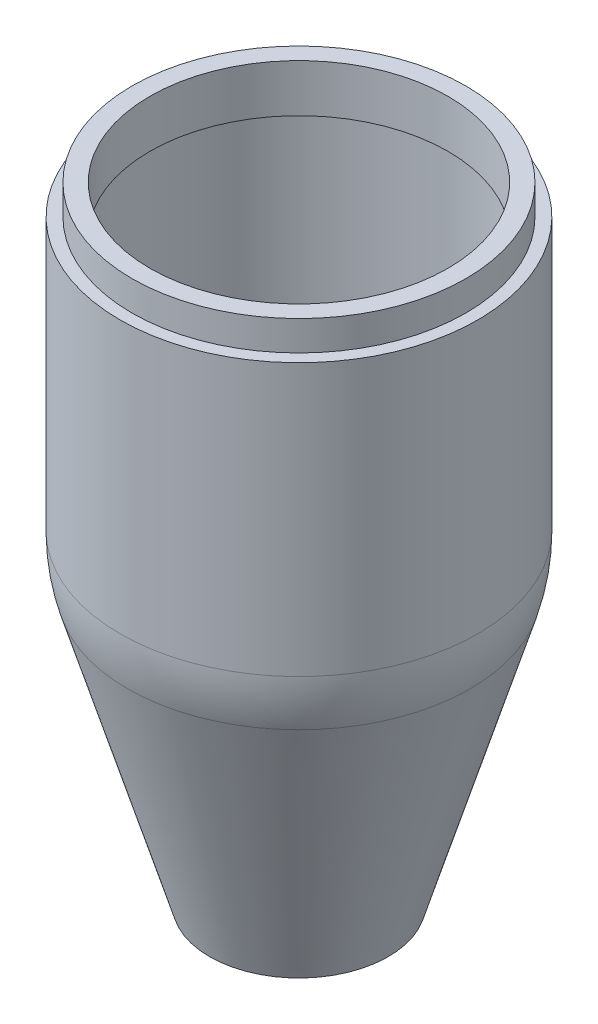
ISO-10303-21;
HEADER;
FILE_DESCRIPTION(('STEP AP214'),'2;1');
FILE_NAME('part.step','',(''),(''),'','','');
FILE_SCHEMA(('AUTOMOTIVE_DESIGN { 1 0 10303 214 1 1 1 1 }'));
ENDSEC;
DATA;
#1=APPLICATION_CONTEXT('core data for automotive mechanical design processes');
#2=APPLICATION_PROTOCOL_DEFINITION('international standard','automotive_design',2000,#1);
#3=PRODUCT_CONTEXT('',#1,'mechanical');
#4=PRODUCT('Part','Part','',(#3));
#5=PRODUCT_RELATED_PRODUCT_CATEGORY('part','',(#4));
#6=PRODUCT_DEFINITION_FORMATION('','',#4);
#7=PRODUCT_DEFINITION_CONTEXT('part definition',#1,'design');
#8=PRODUCT_DEFINITION('design','',#6,#7);
#9=PRODUCT_DEFINITION_SHAPE('','',#8);
#10=(LENGTH_UNIT() NAMED_UNIT(*) SI_UNIT(.MILLI.,.METRE.));
#11=(NAMED_UNIT(*) PLANE_ANGLE_UNIT() SI_UNIT($,.RADIAN.));
#12=(NAMED_UNIT(*) SI_UNIT($,.STERADIAN.) SOLID_ANGLE_UNIT());
#13=UNCERTAINTY_MEASURE_WITH_UNIT(LENGTH_MEASURE(1.E-05),#10,'distance_accuracy_value','');
#14=(GEOMETRIC_REPRESENTATION_CONTEXT(3) GLOBAL_UNCERTAINTY_ASSIGNED_CONTEXT((#13)) GLOBAL_UNIT_ASSIGNED_CONTEXT((#10,
#11,#12)) REPRESENTATION_CONTEXT('',''));
#15=CARTESIAN_POINT('',(0.,0.,0.));
#16=DIRECTION('',(0.,0.,1.));
#17=DIRECTION('',(1.,0.,0.));
#18=AXIS2_PLACEMENT_3D('',#15,#16,#17);
#19=CARTESIAN_POINT('',(0.,100.,0.));
#20=DIRECTION('',(0.,-1.,0.));
#21=DIRECTION('',(0.,0.,-1.));
#22=AXIS2_PLACEMENT_3D('',#19,#20,#21);
#23=PLANE('',#22);
#24=CARTESIAN_POINT('',(0.,100.,0.));
#25=DIRECTION('',(0.,1.,0.));
#26=DIRECTION('',(0.,0.,1.));
#27=AXIS2_PLACEMENT_3D('',#24,#25,#26);
#28=CIRCLE('',#27,30.);
#29=CARTESIAN_POINT('',(0.,100.,30.));
#30=VERTEX_POINT('',#29);
#31=EDGE_CURVE('E48',#30,#30,#28,.T.);
#32=ORIENTED_EDGE('',*,*,#31,.T.);
#33=EDGE_LOOP('',(#32));
#34=FACE_BOUND('',#33,.T.);
#35=CARTESIAN_POINT('',(0.,100.,0.));
#36=DIRECTION('',(0.,-1.,0.));
#37=DIRECTION('',(0.,0.,-1.));
#38=AXIS2_PLACEMENT_3D('',#35,#36,#37);
#39=CIRCLE('',#38,28.);
#40=CARTESIAN_POINT('',(0.,100.,-28.));
#41=VERTEX_POINT('',#40);
#42=EDGE_CURVE('E10',#41,#41,#39,.F.);
#43=ORIENTED_EDGE('',*,*,#42,.F.);
#44=EDGE_LOOP('',(#43));
#45=FACE_BOUND('',#44,.T.);
#46=ADVANCED_FACE('F41',(#34,#45),#23,.F.);
#47=CARTESIAN_POINT('',(15.,0.,0.));
#48=DIRECTION('',(0.,1.,0.));
#49=DIRECTION('',(0.,0.,1.));
#50=AXIS2_PLACEMENT_3D('',#47,#48,#49);
#51=PLANE('',#50);
#52=CARTESIAN_POINT('',(0.,0.,0.));
#53=DIRECTION('',(0.,1.,0.));
#54=DIRECTION('',(0.,0.,1.));
#55=AXIS2_PLACEMENT_3D('',#52,#53,#54);
#56=CIRCLE('',#55,11.8679080473268);
#57=CARTESIAN_POINT('',(0.,0.,11.8679080473268));
#58=VERTEX_POINT('',#57);
#59=EDGE_CURVE('E71',#58,#58,#56,.T.);
#60=ORIENTED_EDGE('',*,*,#59,.T.);
#61=EDGE_LOOP('',(#60));
#62=FACE_BOUND('',#61,.T.);
#63=CARTESIAN_POINT('',(0.,0.,0.));
#64=DIRECTION('',(0.,1.,0.));
#65=DIRECTION('',(0.,0.,1.));
#66=AXIS2_PLACEMENT_3D('',#63,#64,#65);
#67=CIRCLE('',#66,15.);
#68=CARTESIAN_POINT('',(0.,0.,15.));
#69=VERTEX_POINT('',#68);
#70=EDGE_CURVE('E61',#69,#69,#67,.T.);
#71=ORIENTED_EDGE('',*,*,#70,.F.);
#72=EDGE_LOOP('',(#71));
#73=FACE_BOUND('',#72,.T.);
#74=ADVANCED_FACE('F43',(#62,#73),#51,.F.);
#75=CARTESIAN_POINT('',(0.,126.662122272541,0.));
#76=DIRECTION('',(0.,1.,0.));
#77=DIRECTION('',(0.,0.,1.));
#78=AXIS2_PLACEMENT_3D('',#75,#76,#77);
#79=CYLINDRICAL_SURFACE('',#78,30.);
#80=ORIENTED_EDGE('',*,*,#31,.F.);
#81=EDGE_LOOP('',(#80));
#82=FACE_BOUND('',#81,.T.);
#83=CARTESIAN_POINT('',(0.,54.4030650891055,0.));
#84=DIRECTION('',(0.,1.,0.));
#85=DIRECTION('',(0.,0.,1.));
#86=AXIS2_PLACEMENT_3D('',#83,#84,#85);
#87=CIRCLE('',#86,30.);
#88=CARTESIAN_POINT('',(0.,54.4030650891055,30.));
#89=VERTEX_POINT('',#88);
#90=EDGE_CURVE('E52',#89,#89,#87,.T.);
#91=ORIENTED_EDGE('',*,*,#90,.T.);
#92=EDGE_LOOP('',(#91));
#93=FACE_BOUND('',#92,.T.);
#94=ADVANCED_FACE('F114',(#82,#93),#79,.T.);
#95=CARTESIAN_POINT('',(0.,54.4030650891055,0.));
#96=DIRECTION('',(0.,1.,0.));
#97=DIRECTION('',(1.,0.,0.));
#98=AXIS2_PLACEMENT_3D('',#95,#96,#97);
#99=SPHERICAL_SURFACE('',#98,30.);
#100=ORIENTED_EDGE('',*,*,#90,.F.);
#101=EDGE_LOOP('',(#100));
#102=FACE_BOUND('',#101,.T.);
#103=CARTESIAN_POINT('',(0.,45.7826285221151,0.));
#104=DIRECTION('',(0.,1.,0.));
#105=DIRECTION('',(0.,0.,1.));
#106=AXIS2_PLACEMENT_3D('',#103,#104,#105);
#107=CIRCLE('',#106,28.7347885566345);
#108=CARTESIAN_POINT('',(0.,45.7826285221151,28.7347885566345));
#109=VERTEX_POINT('',#108);
#110=EDGE_CURVE('E56',#109,#109,#107,.T.);
#111=ORIENTED_EDGE('',*,*,#110,.T.);
#112=EDGE_LOOP('',(#111));
#113=FACE_BOUND('',#112,.T.);
#114=ADVANCED_FACE('F120',(#102,#113),#99,.T.);
#115=CARTESIAN_POINT('',(0.,0.,0.));
#116=DIRECTION('',(0.,1.,0.));
#117=DIRECTION('',(0.,0.,1.));
#118=AXIS2_PLACEMENT_3D('',#115,#116,#117);
#119=CONICAL_SURFACE('',#118,15.,0.291456794477867);
#120=ORIENTED_EDGE('',*,*,#110,.F.);
#121=EDGE_LOOP('',(#120));
#122=FACE_BOUND('',#121,.T.);
#123=ORIENTED_EDGE('',*,*,#70,.T.);
#124=EDGE_LOOP('',(#123));
#125=FACE_BOUND('',#124,.T.);
#126=ADVANCED_FACE('F124',(#122,#125),#119,.T.);
#127=CARTESIAN_POINT('',(0.,105.,0.));
#128=DIRECTION('',(0.,1.,0.));
#129=DIRECTION('',(0.,0.,1.));
#130=AXIS2_PLACEMENT_3D('',#127,#128,#129);
#131=PLANE('',#130);
#132=CARTESIAN_POINT('',(0.,105.,0.));
#133=DIRECTION('',(0.,1.,0.));
#134=DIRECTION('',(0.,0.,1.));
#135=AXIS2_PLACEMENT_3D('',#132,#133,#134);
#136=CIRCLE('',#135,28.);
#137=CARTESIAN_POINT('',(0.,105.,28.));
#138=VERTEX_POINT('',#137);
#139=EDGE_CURVE('E64',#138,#138,#136,.T.);
#140=ORIENTED_EDGE('',*,*,#139,.T.);
#141=EDGE_LOOP('',(#140));
#142=FACE_BOUND('',#141,.T.);
#143=CARTESIAN_POINT('',(0.,105.,0.));
#144=DIRECTION('',(0.,1.,0.));
#145=DIRECTION('',(-1.,0.,0.));
#146=AXIS2_PLACEMENT_3D('',#143,#144,#145);
#147=CIRCLE('',#146,25.);
#148=CARTESIAN_POINT('',(-25.,105.,0.));
#149=VERTEX_POINT('',#148);
#150=EDGE_CURVE('E67',#149,#149,#147,.T.);
#151=ORIENTED_EDGE('',*,*,#150,.F.);
#152=EDGE_LOOP('',(#151));
#153=FACE_BOUND('',#152,.T.);
#154=ADVANCED_FACE('F104',(#142,#153),#131,.T.);
#155=CARTESIAN_POINT('',(0.,105.,0.));
#156=DIRECTION('',(0.,-1.,0.));
#157=DIRECTION('',(0.,0.,-1.));
#158=AXIS2_PLACEMENT_3D('',#155,#156,#157);
#159=CYLINDRICAL_SURFACE('',#158,28.);
#160=ORIENTED_EDGE('',*,*,#139,.F.);
#161=EDGE_LOOP('',(#160));
#162=FACE_BOUND('',#161,.T.);
#163=ORIENTED_EDGE('',*,*,#42,.T.);
#164=EDGE_LOOP('',(#163));
#165=FACE_BOUND('',#164,.T.);
#166=ADVANCED_FACE('F97',(#162,#165),#159,.T.);
#167=CARTESIAN_POINT('',(0.,105.,0.));
#168=DIRECTION('',(0.,-1.,0.));
#169=DIRECTION('',(0.,0.,-1.));
#170=AXIS2_PLACEMENT_3D('',#167,#168,#169);
#171=CYLINDRICAL_SURFACE('',#170,25.);
#172=ORIENTED_EDGE('',*,*,#150,.T.);
#173=EDGE_LOOP('',(#172));
#174=FACE_BOUND('',#173,.T.);
#175=CARTESIAN_POINT('',(0.,97.,0.));
#176=DIRECTION('',(0.,-1.,0.));
#177=DIRECTION('',(0.,0.,-1.));
#178=AXIS2_PLACEMENT_3D('',#175,#176,#177);
#179=CIRCLE('',#178,25.);
#180=CARTESIAN_POINT('',(0.,97.,-25.));
#181=VERTEX_POINT('',#180);
#182=EDGE_CURVE('E70',#181,#181,#179,.F.);
#183=ORIENTED_EDGE('',*,*,#182,.F.);
#184=EDGE_LOOP('',(#183));
#185=FACE_BOUND('',#184,.T.);
#186=ADVANCED_FACE('F92',(#174,#185),#171,.F.);
#187=CARTESIAN_POINT('',(0.,97.,0.));
#188=DIRECTION('',(0.,-1.,0.));
#189=DIRECTION('',(0.,0.,-1.));
#190=AXIS2_PLACEMENT_3D('',#187,#188,#189);
#191=PLANE('',#190);
#192=CARTESIAN_POINT('',(0.,97.,0.));
#193=DIRECTION('',(0.,-1.,0.));
#194=DIRECTION('',(0.,0.,-1.));
#195=AXIS2_PLACEMENT_3D('',#192,#193,#194);
#196=CIRCLE('',#195,27.);
#197=CARTESIAN_POINT('',(0.,97.,-27.));
#198=VERTEX_POINT('',#197);
#199=EDGE_CURVE('E80',#198,#198,#196,.F.);
#200=ORIENTED_EDGE('',*,*,#199,.F.);
#201=EDGE_LOOP('',(#200));
#202=FACE_BOUND('',#201,.T.);
#203=ORIENTED_EDGE('',*,*,#182,.T.);
#204=EDGE_LOOP('',(#203));
#205=FACE_BOUND('',#204,.T.);
#206=ADVANCED_FACE('F89',(#202,#205),#191,.T.);
#207=CARTESIAN_POINT('',(0.,126.662122272541,0.));
#208=DIRECTION('',(0.,1.,0.));
#209=DIRECTION('',(0.,0.,1.));
#210=AXIS2_PLACEMENT_3D('',#207,#208,#209);
#211=CYLINDRICAL_SURFACE('',#210,27.);
#212=ORIENTED_EDGE('',*,*,#199,.T.);
#213=EDGE_LOOP('',(#212));
#214=FACE_BOUND('',#213,.T.);
#215=CARTESIAN_POINT('',(0.,54.4030650891055,0.));
#216=DIRECTION('',(0.,1.,0.));
#217=DIRECTION('',(0.,0.,1.));
#218=AXIS2_PLACEMENT_3D('',#215,#216,#217);
#219=CIRCLE('',#218,27.);
#220=CARTESIAN_POINT('',(0.,54.4030650891055,27.));
#221=VERTEX_POINT('',#220);
#222=EDGE_CURVE('E77',#221,#221,#219,.T.);
#223=ORIENTED_EDGE('',*,*,#222,.F.);
#224=EDGE_LOOP('',(#223));
#225=FACE_BOUND('',#224,.T.);
#226=ADVANCED_FACE('F86',(#214,#225),#211,.F.);
#227=CARTESIAN_POINT('',(0.,54.4030650891055,0.));
#228=DIRECTION('',(0.,1.,0.));
#229=DIRECTION('',(1.,0.,0.));
#230=AXIS2_PLACEMENT_3D('',#227,#228,#229);
#231=SPHERICAL_SURFACE('',#230,27.);
#232=ORIENTED_EDGE('',*,*,#222,.T.);
#233=EDGE_LOOP('',(#232));
#234=FACE_BOUND('',#233,.T.);
#235=CARTESIAN_POINT('',(0.,46.6446721788141,0.));
#236=DIRECTION('',(0.,1.,0.));
#237=DIRECTION('',(0.,0.,1.));
#238=AXIS2_PLACEMENT_3D('',#235,#236,#237);
#239=CIRCLE('',#238,25.8613097009711);
#240=CARTESIAN_POINT('',(0.,46.6446721788141,25.8613097009711));
#241=VERTEX_POINT('',#240);
#242=EDGE_CURVE('E74',#241,#241,#239,.T.);
#243=ORIENTED_EDGE('',*,*,#242,.F.);
#244=EDGE_LOOP('',(#243));
#245=FACE_BOUND('',#244,.T.);
#246=ADVANCED_FACE('F166',(#234,#245),#231,.F.);
#247=CARTESIAN_POINT('',(0.,0.862043656699037,0.));
#248=DIRECTION('',(0.,1.,0.));
#249=DIRECTION('',(0.,0.,1.));
#250=AXIS2_PLACEMENT_3D('',#247,#248,#249);
#251=CONICAL_SURFACE('',#250,12.1265211443365,0.291456794477867);
#252=ORIENTED_EDGE('',*,*,#242,.T.);
#253=EDGE_LOOP('',(#252));
#254=FACE_BOUND('',#253,.T.);
#255=ORIENTED_EDGE('',*,*,#59,.F.);
#256=EDGE_LOOP('',(#255));
#257=FACE_BOUND('',#256,.T.);
#258=ADVANCED_FACE('F173',(#254,#257),#251,.F.);
#259=CLOSED_SHELL('',(#46,#74,#94,#114,#126,#154,#166,#186,#206,#226,#246,#258));
#260=MANIFOLD_SOLID_BREP('B2',#259);
#261=ADVANCED_BREP_SHAPE_REPRESENTATION('',(#18,#260),#14);
#262=SHAPE_DEFINITION_REPRESENTATION(#9,#261);
ENDSEC;
END-ISO-10303-21;
